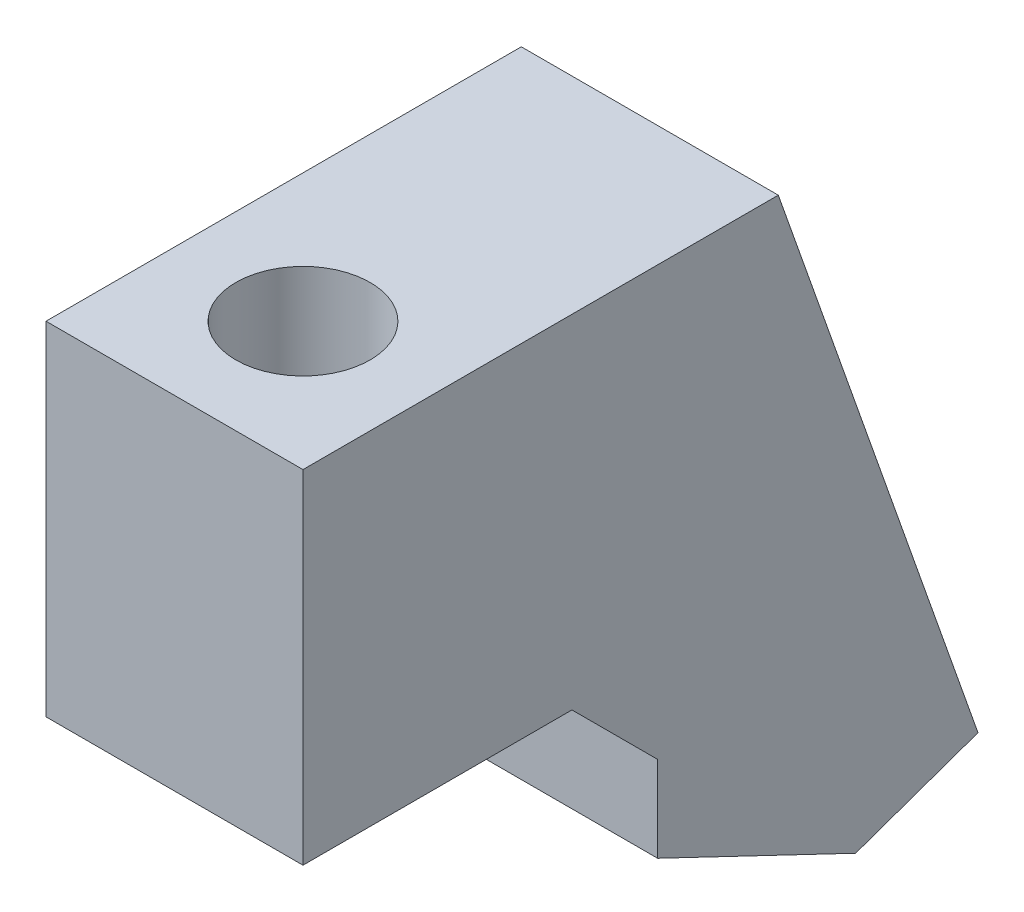
ISO-10303-21;
HEADER;
FILE_DESCRIPTION(('STEP AP214'),'2;1');
FILE_NAME('part.step','',(''),(''),'','','');
FILE_SCHEMA(('AUTOMOTIVE_DESIGN { 1 0 10303 214 1 1 1 1 }'));
ENDSEC;
DATA;
#1=APPLICATION_CONTEXT('core data for automotive mechanical design processes');
#2=APPLICATION_PROTOCOL_DEFINITION('international standard','automotive_design',2000,#1);
#3=PRODUCT_CONTEXT('',#1,'mechanical');
#4=PRODUCT('Part','Part','',(#3));
#5=PRODUCT_RELATED_PRODUCT_CATEGORY('part','',(#4));
#6=PRODUCT_DEFINITION_FORMATION('','',#4);
#7=PRODUCT_DEFINITION_CONTEXT('part definition',#1,'design');
#8=PRODUCT_DEFINITION('design','',#6,#7);
#9=PRODUCT_DEFINITION_SHAPE('','',#8);
#10=(LENGTH_UNIT() NAMED_UNIT(*) SI_UNIT(.MILLI.,.METRE.));
#11=(NAMED_UNIT(*) PLANE_ANGLE_UNIT() SI_UNIT($,.RADIAN.));
#12=(NAMED_UNIT(*) SI_UNIT($,.STERADIAN.) SOLID_ANGLE_UNIT());
#13=UNCERTAINTY_MEASURE_WITH_UNIT(LENGTH_MEASURE(1.E-05),#10,'distance_accuracy_value','');
#14=(GEOMETRIC_REPRESENTATION_CONTEXT(3) GLOBAL_UNCERTAINTY_ASSIGNED_CONTEXT((#13)) GLOBAL_UNIT_ASSIGNED_CONTEXT((#10,
#11,#12)) REPRESENTATION_CONTEXT('',''));
#15=CARTESIAN_POINT('',(0.,0.,0.));
#16=DIRECTION('',(0.,0.,1.));
#17=DIRECTION('',(1.,0.,0.));
#18=AXIS2_PLACEMENT_3D('',#15,#16,#17);
#19=CARTESIAN_POINT('',(4.7625,25.4,-30.7900004275738));
#20=DIRECTION('',(0.,1.,0.));
#21=DIRECTION('',(0.,0.,1.));
#22=AXIS2_PLACEMENT_3D('',#19,#20,#21);
#23=PLANE('',#22);
#24=CARTESIAN_POINT('',(0.,25.4,-22.4080004275738));
#25=DIRECTION('',(0.,1.,0.));
#26=DIRECTION('',(0.,0.,1.));
#27=AXIS2_PLACEMENT_3D('',#24,#25,#26);
#28=CIRCLE('',#27,2.4892);
#29=CARTESIAN_POINT('',(0.,25.4,-19.9188004275738));
#30=VERTEX_POINT('',#29);
#31=EDGE_CURVE('E129',#30,#30,#28,.T.);
#32=ORIENTED_EDGE('',*,*,#31,.T.);
#33=EDGE_LOOP('',(#32));
#34=FACE_BOUND('',#33,.T.);
#35=DIRECTION('',(0.,0.,-1.));
#36=VECTOR('',#35,1.);
#37=CARTESIAN_POINT('',(-4.7625,25.4,-30.7900004275738));
#38=LINE('',#37,#36);
#39=CARTESIAN_POINT('',(-4.7625,25.4,-17.6455004275738));
#40=VERTEX_POINT('',#39);
#41=CARTESIAN_POINT('',(-4.7625,25.4,-27.6150004275738));
#42=VERTEX_POINT('',#41);
#43=EDGE_CURVE('E137',#40,#42,#38,.T.);
#44=ORIENTED_EDGE('',*,*,#43,.T.);
#45=DIRECTION('',(1.,0.,0.));
#46=VECTOR('',#45,1.);
#47=CARTESIAN_POINT('',(4.7625,25.4,-27.6150004275738));
#48=LINE('',#47,#46);
#49=CARTESIAN_POINT('',(4.7625,25.4,-27.6150004275738));
#50=VERTEX_POINT('',#49);
#51=EDGE_CURVE('E52',#42,#50,#48,.T.);
#52=ORIENTED_EDGE('',*,*,#51,.T.);
#53=DIRECTION('',(0.,0.,-1.));
#54=VECTOR('',#53,1.);
#55=CARTESIAN_POINT('',(4.7625,25.4,-30.7900004275738));
#56=LINE('',#55,#54);
#57=CARTESIAN_POINT('',(4.7625,25.4,-17.6455004275738));
#58=VERTEX_POINT('',#57);
#59=EDGE_CURVE('E138',#58,#50,#56,.T.);
#60=ORIENTED_EDGE('',*,*,#59,.F.);
#61=DIRECTION('',(-1.,0.,0.));
#62=VECTOR('',#61,1.);
#63=CARTESIAN_POINT('',(4.7625,25.4,-17.6455004275738));
#64=LINE('',#63,#62);
#65=EDGE_CURVE('E153',#58,#40,#64,.T.);
#66=ORIENTED_EDGE('',*,*,#65,.T.);
#67=EDGE_LOOP('',(#44,#52,#60,#66));
#68=FACE_BOUND('',#67,.T.);
#69=ADVANCED_FACE('F36',(#34,#68),#23,.F.);
#70=CARTESIAN_POINT('',(4.7625,19.05,-30.7900004275738));
#71=DIRECTION('',(0.,0.,-1.));
#72=DIRECTION('',(-1.,0.,0.));
#73=AXIS2_PLACEMENT_3D('',#70,#71,#72);
#74=PLANE('',#73);
#75=DIRECTION('',(0.,-1.,0.));
#76=VECTOR('',#75,1.);
#77=CARTESIAN_POINT('',(4.7625,19.05,-30.7900004275738));
#78=LINE('',#77,#76);
#79=CARTESIAN_POINT('',(4.7625,22.225,-30.7900004275738));
#80=VERTEX_POINT('',#79);
#81=CARTESIAN_POINT('',(4.7625,19.05,-30.7900004275738));
#82=VERTEX_POINT('',#81);
#83=EDGE_CURVE('E140',#80,#82,#78,.T.);
#84=ORIENTED_EDGE('',*,*,#83,.F.);
#85=DIRECTION('',(-1.,0.,0.));
#86=VECTOR('',#85,1.);
#87=CARTESIAN_POINT('',(-4.7625,22.225,-30.7900004275738));
#88=LINE('',#87,#86);
#89=CARTESIAN_POINT('',(-4.7625,22.225,-30.7900004275738));
#90=VERTEX_POINT('',#89);
#91=EDGE_CURVE('E114',#80,#90,#88,.T.);
#92=ORIENTED_EDGE('',*,*,#91,.T.);
#93=DIRECTION('',(0.,-1.,0.));
#94=VECTOR('',#93,1.);
#95=CARTESIAN_POINT('',(-4.7625,19.05,-30.7900004275738));
#96=LINE('',#95,#94);
#97=CARTESIAN_POINT('',(-4.7625,19.05,-30.7900004275738));
#98=VERTEX_POINT('',#97);
#99=EDGE_CURVE('E155',#90,#98,#96,.T.);
#100=ORIENTED_EDGE('',*,*,#99,.T.);
#101=DIRECTION('',(-1.,0.,0.));
#102=VECTOR('',#101,1.);
#103=CARTESIAN_POINT('',(4.7625,19.05,-30.7900004275738));
#104=LINE('',#103,#102);
#105=EDGE_CURVE('E115',#82,#98,#104,.T.);
#106=ORIENTED_EDGE('',*,*,#105,.F.);
#107=EDGE_LOOP('',(#84,#92,#100,#106));
#108=FACE_BOUND('',#107,.T.);
#109=ADVANCED_FACE('F187',(#108),#74,.F.);
#110=CARTESIAN_POINT('',(4.7625,15.5419119338014,-38.1298295613114));
#111=DIRECTION('',(0.,0.902242563984342,-0.431228890190534));
#112=DIRECTION('',(0.,0.431228890190534,0.902242563984342));
#113=AXIS2_PLACEMENT_3D('',#110,#111,#112);
#114=PLANE('',#113);
#115=DIRECTION('',(-1.,0.,0.));
#116=VECTOR('',#115,1.);
#117=CARTESIAN_POINT('',(4.7625,18.4173855339641,-32.1135937925675));
#118=LINE('',#117,#116);
#119=CARTESIAN_POINT('',(1.61399409411482,18.4173855339641,-32.1135937925675));
#120=VERTEX_POINT('',#119);
#121=CARTESIAN_POINT('',(-1.61399409411482,18.4173855339641,-32.1135937925675));
#122=VERTEX_POINT('',#121);
#123=EDGE_CURVE('E107',#120,#122,#118,.T.);
#124=ORIENTED_EDGE('',*,*,#123,.F.);
#125=CARTESIAN_POINT('',(0.,19.0272032264453,-30.8376971841929));
#126=DIRECTION('',(0.,0.902242563984342,-0.431228890190534));
#127=DIRECTION('',(0.,-0.431228890190534,-0.902242563984342));
#128=AXIS2_PLACEMENT_3D('',#125,#126,#127);
#129=ELLIPSE('',#128,2.68509658019967,1.89865);
#130=EDGE_CURVE('E119',#120,#122,#129,.T.);
#131=ORIENTED_EDGE('',*,*,#130,.T.);
#132=EDGE_LOOP('',(#124,#131));
#133=FACE_BOUND('',#132,.T.);
#134=DIRECTION('',(0.,-0.431228890190534,-0.902242563984342));
#135=VECTOR('',#134,1.);
#136=CARTESIAN_POINT('',(-4.7625,15.5419119338014,-38.1298295613114));
#137=LINE('',#136,#135);
#138=CARTESIAN_POINT('',(-4.7625,15.5419119338014,-38.1298295613114));
#139=VERTEX_POINT('',#138);
#140=EDGE_CURVE('E157',#98,#139,#137,.T.);
#141=ORIENTED_EDGE('',*,*,#140,.T.);
#142=DIRECTION('',(-1.,0.,0.));
#143=VECTOR('',#142,1.);
#144=CARTESIAN_POINT('',(4.7625,15.5419119338014,-38.1298295613114));
#145=LINE('',#144,#143);
#146=CARTESIAN_POINT('',(4.7625,15.5419119338014,-38.1298295613114));
#147=VERTEX_POINT('',#146);
#148=EDGE_CURVE('E177',#147,#139,#145,.T.);
#149=ORIENTED_EDGE('',*,*,#148,.F.);
#150=DIRECTION('',(0.,-0.431228890190534,-0.902242563984342));
#151=VECTOR('',#150,1.);
#152=CARTESIAN_POINT('',(4.7625,15.5419119338014,-38.1298295613114));
#153=LINE('',#152,#151);
#154=EDGE_CURVE('E143',#82,#147,#153,.T.);
#155=ORIENTED_EDGE('',*,*,#154,.F.);
#156=ORIENTED_EDGE('',*,*,#105,.T.);
#157=EDGE_LOOP('',(#141,#149,#155,#156));
#158=FACE_BOUND('',#157,.T.);
#159=ADVANCED_FACE('F123',(#133,#158),#114,.F.);
#160=CARTESIAN_POINT('',(4.7625,17.1438984199064,-42.6651612683268));
#161=DIRECTION('',(0.,0.942906707765741,0.333056962771192));
#162=DIRECTION('',(0.,-0.333056962771192,0.942906707765741));
#163=AXIS2_PLACEMENT_3D('',#160,#161,#162);
#164=PLANE('',#163);
#165=DIRECTION('',(0.,0.333056962771192,-0.942906707765741));
#166=VECTOR('',#165,1.);
#167=CARTESIAN_POINT('',(-4.7625,17.1438984199064,-42.6651612683268));
#168=LINE('',#167,#166);
#169=CARTESIAN_POINT('',(-4.7625,17.1438984199064,-42.6651612683268));
#170=VERTEX_POINT('',#169);
#171=EDGE_CURVE('E159',#139,#170,#168,.T.);
#172=ORIENTED_EDGE('',*,*,#171,.T.);
#173=DIRECTION('',(-1.,0.,0.));
#174=VECTOR('',#173,1.);
#175=CARTESIAN_POINT('',(4.7625,17.1438984199064,-42.6651612683268));
#176=LINE('',#175,#174);
#177=CARTESIAN_POINT('',(4.7625,17.1438984199064,-42.6651612683268));
#178=VERTEX_POINT('',#177);
#179=EDGE_CURVE('E174',#178,#170,#176,.T.);
#180=ORIENTED_EDGE('',*,*,#179,.F.);
#181=DIRECTION('',(0.,0.333056962771192,-0.942906707765741));
#182=VECTOR('',#181,1.);
#183=CARTESIAN_POINT('',(4.7625,17.1438984199064,-42.6651612683268));
#184=LINE('',#183,#182);
#185=EDGE_CURVE('E145',#147,#178,#184,.T.);
#186=ORIENTED_EDGE('',*,*,#185,.F.);
#187=ORIENTED_EDGE('',*,*,#148,.T.);
#188=EDGE_LOOP('',(#172,#180,#186,#187));
#189=FACE_BOUND('',#188,.T.);
#190=ADVANCED_FACE('F199',(#189),#164,.F.);
#191=CARTESIAN_POINT('',(4.7625,38.1,-35.2629702707371));
#192=DIRECTION('',(0.,-0.333056962771192,0.942906707765741));
#193=DIRECTION('',(0.,-0.942906707765741,-0.333056962771192));
#194=AXIS2_PLACEMENT_3D('',#191,#192,#193);
#195=PLANE('',#194);
#196=CARTESIAN_POINT('',(0.,32.7112881651188,-37.1663908129745));
#197=DIRECTION('',(0.,0.333056962771192,-0.942906707765741));
#198=DIRECTION('',(0.,0.942906707765741,0.333056962771192));
#199=AXIS2_PLACEMENT_3D('',#196,#197,#198);
#200=CIRCLE('',#199,1.89865);
#201=CARTESIAN_POINT('',(0.,34.5015379858182,-36.5340322106089));
#202=VERTEX_POINT('',#201);
#203=EDGE_CURVE('E120',#202,#202,#200,.T.);
#204=ORIENTED_EDGE('',*,*,#203,.F.);
#205=EDGE_LOOP('',(#204));
#206=FACE_BOUND('',#205,.T.);
#207=CARTESIAN_POINT('',(0.,22.5326102547876,-40.7617407260895));
#208=DIRECTION('',(0.,0.333056962771192,-0.942906707765741));
#209=DIRECTION('',(0.,0.942906707765741,0.333056962771192));
#210=AXIS2_PLACEMENT_3D('',#207,#208,#209);
#211=CIRCLE('',#210,1.89865);
#212=CARTESIAN_POINT('',(0.,24.322860075487,-40.129382123724));
#213=VERTEX_POINT('',#212);
#214=EDGE_CURVE('E121',#213,#213,#211,.T.);
#215=ORIENTED_EDGE('',*,*,#214,.F.);
#216=EDGE_LOOP('',(#215));
#217=FACE_BOUND('',#216,.T.);
#218=DIRECTION('',(0.,0.942906707765741,0.333056962771192));
#219=VECTOR('',#218,1.);
#220=CARTESIAN_POINT('',(-4.7625,38.1,-35.2629702707371));
#221=LINE('',#220,#219);
#222=CARTESIAN_POINT('',(-4.7625,38.1,-35.2629702707371));
#223=VERTEX_POINT('',#222);
#224=EDGE_CURVE('E161',#170,#223,#221,.T.);
#225=ORIENTED_EDGE('',*,*,#224,.T.);
#226=DIRECTION('',(-1.,0.,0.));
#227=VECTOR('',#226,1.);
#228=CARTESIAN_POINT('',(4.7625,38.1,-35.2629702707371));
#229=LINE('',#228,#227);
#230=CARTESIAN_POINT('',(4.7625,38.1,-35.2629702707371));
#231=VERTEX_POINT('',#230);
#232=EDGE_CURVE('E171',#231,#223,#229,.T.);
#233=ORIENTED_EDGE('',*,*,#232,.F.);
#234=DIRECTION('',(0.,0.942906707765741,0.333056962771192));
#235=VECTOR('',#234,1.);
#236=CARTESIAN_POINT('',(4.7625,38.1,-35.2629702707371));
#237=LINE('',#236,#235);
#238=EDGE_CURVE('E147',#178,#231,#237,.T.);
#239=ORIENTED_EDGE('',*,*,#238,.F.);
#240=ORIENTED_EDGE('',*,*,#179,.T.);
#241=EDGE_LOOP('',(#225,#233,#239,#240));
#242=FACE_BOUND('',#241,.T.);
#243=ADVANCED_FACE('F224',(#206,#217,#242),#195,.F.);
#244=CARTESIAN_POINT('',(4.7625,38.1,-17.6455004275738));
#245=DIRECTION('',(0.,-1.,0.));
#246=DIRECTION('',(0.,0.,-1.));
#247=AXIS2_PLACEMENT_3D('',#244,#245,#246);
#248=PLANE('',#247);
#249=CARTESIAN_POINT('',(0.,38.1,-22.4080004275738));
#250=DIRECTION('',(0.,1.,0.));
#251=DIRECTION('',(0.,0.,1.));
#252=AXIS2_PLACEMENT_3D('',#249,#250,#251);
#253=CIRCLE('',#252,2.4892);
#254=CARTESIAN_POINT('',(0.,38.1,-19.9188004275738));
#255=VERTEX_POINT('',#254);
#256=EDGE_CURVE('E125',#255,#255,#253,.T.);
#257=ORIENTED_EDGE('',*,*,#256,.F.);
#258=EDGE_LOOP('',(#257));
#259=FACE_BOUND('',#258,.T.);
#260=DIRECTION('',(0.,0.,1.));
#261=VECTOR('',#260,1.);
#262=CARTESIAN_POINT('',(-4.7625,38.1,-17.6455004275738));
#263=LINE('',#262,#261);
#264=CARTESIAN_POINT('',(-4.7625,38.1,-17.6455004275738));
#265=VERTEX_POINT('',#264);
#266=EDGE_CURVE('E163',#223,#265,#263,.T.);
#267=ORIENTED_EDGE('',*,*,#266,.T.);
#268=DIRECTION('',(-1.,0.,0.));
#269=VECTOR('',#268,1.);
#270=CARTESIAN_POINT('',(4.7625,38.1,-17.6455004275738));
#271=LINE('',#270,#269);
#272=CARTESIAN_POINT('',(4.7625,38.1,-17.6455004275738));
#273=VERTEX_POINT('',#272);
#274=EDGE_CURVE('E168',#273,#265,#271,.T.);
#275=ORIENTED_EDGE('',*,*,#274,.F.);
#276=DIRECTION('',(0.,0.,1.));
#277=VECTOR('',#276,1.);
#278=CARTESIAN_POINT('',(4.7625,38.1,-17.6455004275738));
#279=LINE('',#278,#277);
#280=EDGE_CURVE('E149',#231,#273,#279,.T.);
#281=ORIENTED_EDGE('',*,*,#280,.F.);
#282=ORIENTED_EDGE('',*,*,#232,.T.);
#283=EDGE_LOOP('',(#267,#275,#281,#282));
#284=FACE_BOUND('',#283,.T.);
#285=ADVANCED_FACE('F227',(#259,#284),#248,.F.);
#286=CARTESIAN_POINT('',(4.7625,25.4,-17.6455004275738));
#287=DIRECTION('',(0.,0.,-1.));
#288=DIRECTION('',(-1.,0.,0.));
#289=AXIS2_PLACEMENT_3D('',#286,#287,#288);
#290=PLANE('',#289);
#291=DIRECTION('',(0.,-1.,0.));
#292=VECTOR('',#291,1.);
#293=CARTESIAN_POINT('',(-4.7625,25.4,-17.6455004275738));
#294=LINE('',#293,#292);
#295=EDGE_CURVE('E141',#265,#40,#294,.T.);
#296=ORIENTED_EDGE('',*,*,#295,.T.);
#297=ORIENTED_EDGE('',*,*,#65,.F.);
#298=DIRECTION('',(0.,-1.,0.));
#299=VECTOR('',#298,1.);
#300=CARTESIAN_POINT('',(4.7625,25.4,-17.6455004275738));
#301=LINE('',#300,#299);
#302=EDGE_CURVE('E151',#273,#58,#301,.T.);
#303=ORIENTED_EDGE('',*,*,#302,.F.);
#304=ORIENTED_EDGE('',*,*,#274,.T.);
#305=EDGE_LOOP('',(#296,#297,#303,#304));
#306=FACE_BOUND('',#305,.T.);
#307=ADVANCED_FACE('F231',(#306),#290,.F.);
#308=CARTESIAN_POINT('',(4.7625,0.,0.));
#309=DIRECTION('',(-1.,0.,0.));
#310=DIRECTION('',(0.,0.,1.));
#311=AXIS2_PLACEMENT_3D('',#308,#309,#310);
#312=PLANE('',#311);
#313=ORIENTED_EDGE('',*,*,#59,.T.);
#314=DIRECTION('',(0.,0.707106781186551,0.707106781186544));
#315=VECTOR('',#314,1.);
#316=CARTESIAN_POINT('',(4.7625,26.5075002137868,-26.507500213787));
#317=LINE('',#316,#315);
#318=EDGE_CURVE('E11',#50,#80,#317,.F.);
#319=ORIENTED_EDGE('',*,*,#318,.T.);
#320=ORIENTED_EDGE('',*,*,#83,.T.);
#321=ORIENTED_EDGE('',*,*,#154,.T.);
#322=ORIENTED_EDGE('',*,*,#185,.T.);
#323=ORIENTED_EDGE('',*,*,#238,.T.);
#324=ORIENTED_EDGE('',*,*,#280,.T.);
#325=ORIENTED_EDGE('',*,*,#302,.T.);
#326=EDGE_LOOP('',(#313,#319,#320,#321,#322,#323,#324,#325));
#327=FACE_BOUND('',#326,.T.);
#328=ADVANCED_FACE('F203',(#327),#312,.F.);
#329=CARTESIAN_POINT('',(-4.7625,0.,0.));
#330=DIRECTION('',(-1.,0.,0.));
#331=DIRECTION('',(0.,0.,1.));
#332=AXIS2_PLACEMENT_3D('',#329,#330,#331);
#333=PLANE('',#332);
#334=ORIENTED_EDGE('',*,*,#43,.F.);
#335=ORIENTED_EDGE('',*,*,#295,.F.);
#336=ORIENTED_EDGE('',*,*,#266,.F.);
#337=ORIENTED_EDGE('',*,*,#224,.F.);
#338=ORIENTED_EDGE('',*,*,#171,.F.);
#339=ORIENTED_EDGE('',*,*,#140,.F.);
#340=ORIENTED_EDGE('',*,*,#99,.F.);
#341=DIRECTION('',(0.,-0.707106781186551,-0.707106781186544));
#342=VECTOR('',#341,1.);
#343=CARTESIAN_POINT('',(-4.7625,22.225,-30.7900004275738));
#344=LINE('',#343,#342);
#345=EDGE_CURVE('E45',#90,#42,#344,.F.);
#346=ORIENTED_EDGE('',*,*,#345,.T.);
#347=EDGE_LOOP('',(#334,#335,#336,#337,#338,#339,#340,#346));
#348=FACE_BOUND('',#347,.T.);
#349=ADVANCED_FACE('F192',(#348),#333,.T.);
#350=CARTESIAN_POINT('',(0.,-14.6051000000002,-22.4080004275738));
#351=DIRECTION('',(0.,1.,0.));
#352=DIRECTION('',(0.,0.,1.));
#353=AXIS2_PLACEMENT_3D('',#350,#351,#352);
#354=CYLINDRICAL_SURFACE('',#353,2.4892);
#355=ORIENTED_EDGE('',*,*,#256,.T.);
#356=EDGE_LOOP('',(#355));
#357=FACE_BOUND('',#356,.T.);
#358=ORIENTED_EDGE('',*,*,#31,.F.);
#359=EDGE_LOOP('',(#358));
#360=FACE_BOUND('',#359,.T.);
#361=ADVANCED_FACE('F238',(#357,#360),#354,.F.);
#362=CARTESIAN_POINT('',(0.,19.360242684392,-31.7805543346208));
#363=DIRECTION('',(0.,0.333056962771192,-0.942906707765741));
#364=DIRECTION('',(0.,0.942906707765741,0.333056962771192));
#365=AXIS2_PLACEMENT_3D('',#362,#363,#364);
#366=PLANE('',#365);
#367=ORIENTED_EDGE('',*,*,#123,.T.);
#368=CARTESIAN_POINT('',(0.,19.360242684392,-31.7805543346208));
#369=DIRECTION('',(0.,0.333056962771192,-0.942906707765741));
#370=DIRECTION('',(0.,0.942906707765741,0.333056962771192));
#371=AXIS2_PLACEMENT_3D('',#368,#369,#370);
#372=CIRCLE('',#371,1.89865);
#373=EDGE_CURVE('E110',#122,#120,#372,.T.);
#374=ORIENTED_EDGE('',*,*,#373,.T.);
#375=EDGE_LOOP('',(#367,#374));
#376=FACE_BOUND('',#375,.T.);
#377=ADVANCED_FACE('F109',(#376),#366,.T.);
#378=CARTESIAN_POINT('',(0.,19.360242684392,-31.7805543346208));
#379=DIRECTION('',(0.,0.333056962771192,-0.942906707765741));
#380=DIRECTION('',(0.,0.942906707765741,0.333056962771192));
#381=AXIS2_PLACEMENT_3D('',#378,#379,#380);
#382=CYLINDRICAL_SURFACE('',#381,1.89865);
#383=ORIENTED_EDGE('',*,*,#214,.T.);
#384=EDGE_LOOP('',(#383));
#385=FACE_BOUND('',#384,.T.);
#386=ORIENTED_EDGE('',*,*,#373,.F.);
#387=ORIENTED_EDGE('',*,*,#130,.F.);
#388=EDGE_LOOP('',(#386,#387));
#389=FACE_BOUND('',#388,.T.);
#390=ADVANCED_FACE('F118',(#385,#389),#382,.F.);
#391=CARTESIAN_POINT('',(0.,29.5389205947232,-28.1852044215058));
#392=DIRECTION('',(0.,0.333056962771192,-0.942906707765741));
#393=DIRECTION('',(0.,0.942906707765741,0.333056962771192));
#394=AXIS2_PLACEMENT_3D('',#391,#392,#393);
#395=CYLINDRICAL_SURFACE('',#394,1.89865);
#396=CARTESIAN_POINT('',(0.,29.5389205947232,-28.1852044215058));
#397=DIRECTION('',(0.,0.333056962771192,-0.942906707765741));
#398=DIRECTION('',(0.,0.942906707765741,0.333056962771192));
#399=AXIS2_PLACEMENT_3D('',#396,#397,#398);
#400=CIRCLE('',#399,1.89865);
#401=CARTESIAN_POINT('',(0.,31.3291704154226,-27.5528458191403));
#402=VERTEX_POINT('',#401);
#403=EDGE_CURVE('E126',#402,#402,#400,.T.);
#404=ORIENTED_EDGE('',*,*,#403,.F.);
#405=EDGE_LOOP('',(#404));
#406=FACE_BOUND('',#405,.T.);
#407=ORIENTED_EDGE('',*,*,#203,.T.);
#408=EDGE_LOOP('',(#407));
#409=FACE_BOUND('',#408,.T.);
#410=ADVANCED_FACE('F210',(#406,#409),#395,.F.);
#411=CARTESIAN_POINT('',(0.,29.5389205947232,-28.1852044215058));
#412=DIRECTION('',(0.,0.333056962771192,-0.942906707765741));
#413=DIRECTION('',(0.,0.942906707765741,0.333056962771192));
#414=AXIS2_PLACEMENT_3D('',#411,#412,#413);
#415=PLANE('',#414);
#416=ORIENTED_EDGE('',*,*,#403,.T.);
#417=EDGE_LOOP('',(#416));
#418=FACE_BOUND('',#417,.T.);
#419=ADVANCED_FACE('F206',(#418),#415,.T.);
#420=CARTESIAN_POINT('',(4.7625,22.225,-30.7900004275738));
#421=DIRECTION('',(0.,-0.707106781186544,0.707106781186551));
#422=DIRECTION('',(1.,0.,0.));
#423=AXIS2_PLACEMENT_3D('',#420,#421,#422);
#424=PLANE('',#423);
#425=ORIENTED_EDGE('',*,*,#318,.F.);
#426=ORIENTED_EDGE('',*,*,#51,.F.);
#427=ORIENTED_EDGE('',*,*,#345,.F.);
#428=ORIENTED_EDGE('',*,*,#91,.F.);
#429=EDGE_LOOP('',(#425,#426,#427,#428));
#430=FACE_BOUND('',#429,.T.);
#431=ADVANCED_FACE('F39',(#430),#424,.T.);
#432=CLOSED_SHELL('',(#69,#109,#159,#190,#243,#285,#307,#328,#349,#361,#377,#390,#410,#419,#431));
#433=MANIFOLD_SOLID_BREP('B2',#432);
#434=ADVANCED_BREP_SHAPE_REPRESENTATION('',(#18,#433),#14);
#435=SHAPE_DEFINITION_REPRESENTATION(#9,#434);
ENDSEC;
END-ISO-10303-21;
